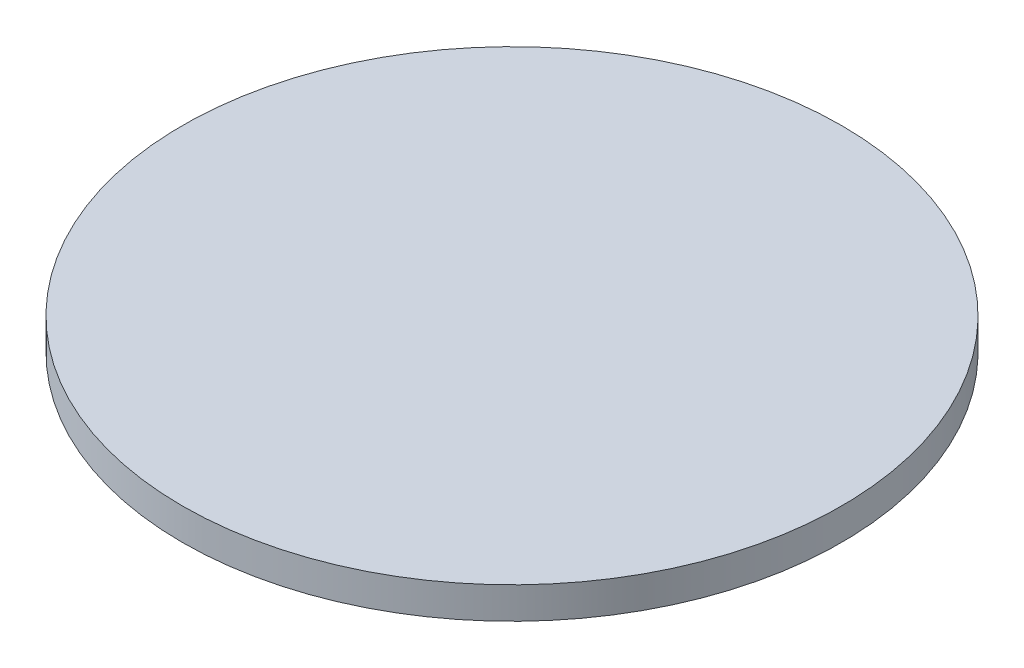
ISO-10303-21;
HEADER;
FILE_DESCRIPTION(('STEP AP214'),'2;1');
FILE_NAME('part.step','',(''),(''),'','','');
FILE_SCHEMA(('AUTOMOTIVE_DESIGN { 1 0 10303 214 1 1 1 1 }'));
ENDSEC;
DATA;
#1=APPLICATION_CONTEXT('core data for automotive mechanical design processes');
#2=APPLICATION_PROTOCOL_DEFINITION('international standard','automotive_design',2000,#1);
#3=PRODUCT_CONTEXT('',#1,'mechanical');
#4=PRODUCT('Part','Part','',(#3));
#5=PRODUCT_RELATED_PRODUCT_CATEGORY('part','',(#4));
#6=PRODUCT_DEFINITION_FORMATION('','',#4);
#7=PRODUCT_DEFINITION_CONTEXT('part definition',#1,'design');
#8=PRODUCT_DEFINITION('design','',#6,#7);
#9=PRODUCT_DEFINITION_SHAPE('','',#8);
#10=(LENGTH_UNIT() NAMED_UNIT(*) SI_UNIT(.MILLI.,.METRE.));
#11=(NAMED_UNIT(*) PLANE_ANGLE_UNIT() SI_UNIT($,.RADIAN.));
#12=(NAMED_UNIT(*) SI_UNIT($,.STERADIAN.) SOLID_ANGLE_UNIT());
#13=UNCERTAINTY_MEASURE_WITH_UNIT(LENGTH_MEASURE(1.E-05),#10,'distance_accuracy_value','');
#14=(GEOMETRIC_REPRESENTATION_CONTEXT(3) GLOBAL_UNCERTAINTY_ASSIGNED_CONTEXT((#13)) GLOBAL_UNIT_ASSIGNED_CONTEXT((#10,
#11,#12)) REPRESENTATION_CONTEXT('',''));
#15=CARTESIAN_POINT('',(0.,0.,0.));
#16=DIRECTION('',(0.,0.,1.));
#17=DIRECTION('',(1.,0.,0.));
#18=AXIS2_PLACEMENT_3D('',#15,#16,#17);
#19=CARTESIAN_POINT('',(0.,3.175,0.));
#20=DIRECTION('',(0.,-1.,0.));
#21=DIRECTION('',(0.,0.,-1.));
#22=AXIS2_PLACEMENT_3D('',#19,#20,#21);
#23=CYLINDRICAL_SURFACE('',#22,33.0835);
#24=CARTESIAN_POINT('',(0.,3.175,0.));
#25=DIRECTION('',(0.,1.,0.));
#26=DIRECTION('',(0.,0.,1.));
#27=AXIS2_PLACEMENT_3D('',#24,#25,#26);
#28=CIRCLE('',#27,33.0835);
#29=CARTESIAN_POINT('',(0.,3.175,33.0835));
#30=VERTEX_POINT('',#29);
#31=EDGE_CURVE('E10',#30,#30,#28,.T.);
#32=ORIENTED_EDGE('',*,*,#31,.F.);
#33=EDGE_LOOP('',(#32));
#34=FACE_BOUND('',#33,.T.);
#35=CARTESIAN_POINT('',(0.,0.,0.));
#36=DIRECTION('',(0.,1.,0.));
#37=DIRECTION('',(0.,0.,1.));
#38=AXIS2_PLACEMENT_3D('',#35,#36,#37);
#39=CIRCLE('',#38,33.0835);
#40=CARTESIAN_POINT('',(0.,0.,33.0835));
#41=VERTEX_POINT('',#40);
#42=EDGE_CURVE('E37',#41,#41,#39,.T.);
#43=ORIENTED_EDGE('',*,*,#42,.T.);
#44=EDGE_LOOP('',(#43));
#45=FACE_BOUND('',#44,.T.);
#46=ADVANCED_FACE('F34',(#34,#45),#23,.T.);
#47=CARTESIAN_POINT('',(0.,3.175,0.));
#48=DIRECTION('',(0.,1.,0.));
#49=DIRECTION('',(0.,0.,1.));
#50=AXIS2_PLACEMENT_3D('',#47,#48,#49);
#51=PLANE('',#50);
#52=ORIENTED_EDGE('',*,*,#31,.T.);
#53=EDGE_LOOP('',(#52));
#54=FACE_BOUND('',#53,.T.);
#55=ADVANCED_FACE('F49',(#54),#51,.T.);
#56=CARTESIAN_POINT('',(0.,0.,0.));
#57=DIRECTION('',(0.,1.,0.));
#58=DIRECTION('',(0.,0.,1.));
#59=AXIS2_PLACEMENT_3D('',#56,#57,#58);
#60=PLANE('',#59);
#61=ORIENTED_EDGE('',*,*,#42,.F.);
#62=EDGE_LOOP('',(#61));
#63=FACE_BOUND('',#62,.T.);
#64=ADVANCED_FACE('F47',(#63),#60,.F.);
#65=CLOSED_SHELL('',(#46,#55,#64));
#66=MANIFOLD_SOLID_BREP('B2',#65);
#67=ADVANCED_BREP_SHAPE_REPRESENTATION('',(#18,#66),#14);
#68=SHAPE_DEFINITION_REPRESENTATION(#9,#67);
ENDSEC;
END-ISO-10303-21;
